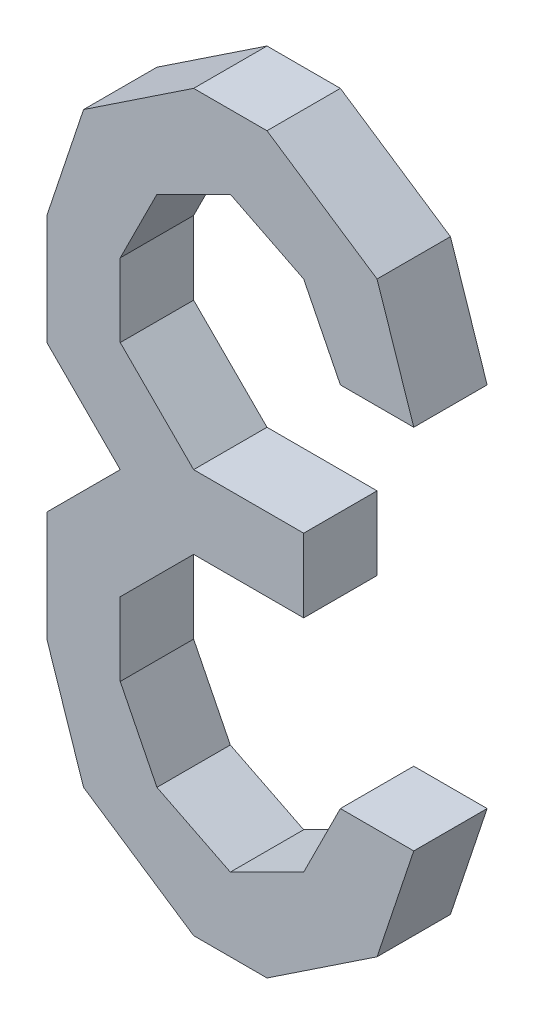
ISO-10303-21;
HEADER;
FILE_DESCRIPTION(('STEP AP214'),'2;1');
FILE_NAME('part.step','',(''),(''),'','','');
FILE_SCHEMA(('AUTOMOTIVE_DESIGN { 1 0 10303 214 1 1 1 1 }'));
ENDSEC;
DATA;
#1=APPLICATION_CONTEXT('core data for automotive mechanical design processes');
#2=APPLICATION_PROTOCOL_DEFINITION('international standard','automotive_design',2000,#1);
#3=PRODUCT_CONTEXT('',#1,'mechanical');
#4=PRODUCT('Part','Part','',(#3));
#5=PRODUCT_RELATED_PRODUCT_CATEGORY('part','',(#4));
#6=PRODUCT_DEFINITION_FORMATION('','',#4);
#7=PRODUCT_DEFINITION_CONTEXT('part definition',#1,'design');
#8=PRODUCT_DEFINITION('design','',#6,#7);
#9=PRODUCT_DEFINITION_SHAPE('','',#8);
#10=(LENGTH_UNIT() NAMED_UNIT(*) SI_UNIT(.MILLI.,.METRE.));
#11=(NAMED_UNIT(*) PLANE_ANGLE_UNIT() SI_UNIT($,.RADIAN.));
#12=(NAMED_UNIT(*) SI_UNIT($,.STERADIAN.) SOLID_ANGLE_UNIT());
#13=UNCERTAINTY_MEASURE_WITH_UNIT(LENGTH_MEASURE(1.E-05),#10,'distance_accuracy_value','');
#14=(GEOMETRIC_REPRESENTATION_CONTEXT(3) GLOBAL_UNCERTAINTY_ASSIGNED_CONTEXT((#13)) GLOBAL_UNIT_ASSIGNED_CONTEXT((#10,
#11,#12)) REPRESENTATION_CONTEXT('',''));
#15=CARTESIAN_POINT('',(0.,0.,0.));
#16=DIRECTION('',(0.,0.,1.));
#17=DIRECTION('',(1.,0.,0.));
#18=AXIS2_PLACEMENT_3D('',#15,#16,#17);
#19=CARTESIAN_POINT('',(0.0635,-0.0635,0.));
#20=DIRECTION('',(0.,0.,1.));
#21=DIRECTION('',(1.,0.,0.));
#22=AXIS2_PLACEMENT_3D('',#19,#20,#21);
#23=PLANE('',#22);
#24=DIRECTION('',(0.832050294337997,0.554700196224998,0.));
#25=VECTOR('',#24,1.);
#26=CARTESIAN_POINT('',(0.0508,-0.1016,0.));
#27=LINE('',#26,#25);
#28=CARTESIAN_POINT('',(0.0126999999999982,-0.126999999999997,0.));
#29=VERTEX_POINT('',#28);
#30=CARTESIAN_POINT('',(0.050799999999997,-0.101599999999999,0.));
#31=VERTEX_POINT('',#30);
#32=EDGE_CURVE('E376',#29,#31,#27,.T.);
#33=ORIENTED_EDGE('',*,*,#32,.F.);
#34=DIRECTION('',(1.,0.,0.));
#35=VECTOR('',#34,1.);
#36=CARTESIAN_POINT('',(0.0127,-0.127,0.));
#37=LINE('',#36,#35);
#38=CARTESIAN_POINT('',(-0.0127,-0.127,0.));
#39=VERTEX_POINT('',#38);
#40=EDGE_CURVE('E371',#39,#29,#37,.T.);
#41=ORIENTED_EDGE('',*,*,#40,.F.);
#42=DIRECTION('',(0.832050294337997,-0.554700196224998,0.));
#43=VECTOR('',#42,1.);
#44=CARTESIAN_POINT('',(-0.0127,-0.127,0.));
#45=LINE('',#44,#43);
#46=CARTESIAN_POINT('',(-0.0508000000000018,-0.101600000000003,0.));
#47=VERTEX_POINT('',#46);
#48=EDGE_CURVE('E366',#47,#39,#45,.T.);
#49=ORIENTED_EDGE('',*,*,#48,.F.);
#50=DIRECTION('',(0.316227766017138,-0.948683298050414,0.));
#51=VECTOR('',#50,1.);
#52=CARTESIAN_POINT('',(-0.0508,-0.1016,0.));
#53=LINE('',#52,#51);
#54=CARTESIAN_POINT('',(-0.063500000000003,-0.063500000000001,0.));
#55=VERTEX_POINT('',#54);
#56=EDGE_CURVE('E361',#55,#47,#53,.T.);
#57=ORIENTED_EDGE('',*,*,#56,.F.);
#58=DIRECTION('',(0.,1.,0.));
#59=VECTOR('',#58,1.);
#60=CARTESIAN_POINT('',(-0.0635,-0.0635,0.));
#61=LINE('',#60,#59);
#62=CARTESIAN_POINT('',(-0.0635,-0.02540000000002,0.));
#63=VERTEX_POINT('',#62);
#64=EDGE_CURVE('E356',#63,#55,#61,.F.);
#65=ORIENTED_EDGE('',*,*,#64,.F.);
#66=DIRECTION('',(-0.707106781186048,-0.707106781187048,0.));
#67=VECTOR('',#66,1.);
#68=CARTESIAN_POINT('',(-0.0635,-0.02540000000002,0.));
#69=LINE('',#68,#67);
#70=CARTESIAN_POINT('',(-0.038100000000002,0.,0.));
#71=VERTEX_POINT('',#70);
#72=EDGE_CURVE('E351',#71,#63,#69,.T.);
#73=ORIENTED_EDGE('',*,*,#72,.F.);
#74=DIRECTION('',(0.707106781187048,-0.707106781186048,0.));
#75=VECTOR('',#74,1.);
#76=CARTESIAN_POINT('',(-0.0381,0.,0.));
#77=LINE('',#76,#75);
#78=CARTESIAN_POINT('',(-0.0635000000000032,0.0253999999999868,0.));
#79=VERTEX_POINT('',#78);
#80=EDGE_CURVE('E346',#79,#71,#77,.T.);
#81=ORIENTED_EDGE('',*,*,#80,.F.);
#82=DIRECTION('',(0.,1.,0.));
#83=VECTOR('',#82,1.);
#84=CARTESIAN_POINT('',(-0.0635,0.02539999999999,0.));
#85=LINE('',#84,#83);
#86=CARTESIAN_POINT('',(-0.0635,0.06349999999998,0.));
#87=VERTEX_POINT('',#86);
#88=EDGE_CURVE('E341',#87,#79,#85,.F.);
#89=ORIENTED_EDGE('',*,*,#88,.F.);
#90=DIRECTION('',(-0.316227766017138,-0.948683298050414,0.));
#91=VECTOR('',#90,1.);
#92=CARTESIAN_POINT('',(-0.0635,0.06349999999998,0.));
#93=LINE('',#92,#91);
#94=CARTESIAN_POINT('',(-0.0507999999999955,0.101599999999998,0.));
#95=VERTEX_POINT('',#94);
#96=EDGE_CURVE('E336',#95,#87,#93,.T.);
#97=ORIENTED_EDGE('',*,*,#96,.F.);
#98=DIRECTION('',(-0.832050294337997,-0.554700196224998,0.));
#99=VECTOR('',#98,1.);
#100=CARTESIAN_POINT('',(-0.0508,0.1016,0.));
#101=LINE('',#100,#99);
#102=CARTESIAN_POINT('',(-0.0126999999999982,0.126999999999997,0.));
#103=VERTEX_POINT('',#102);
#104=EDGE_CURVE('E331',#103,#95,#101,.T.);
#105=ORIENTED_EDGE('',*,*,#104,.F.);
#106=DIRECTION('',(1.,0.,0.));
#107=VECTOR('',#106,1.);
#108=CARTESIAN_POINT('',(-0.0127,0.127,0.));
#109=LINE('',#108,#107);
#110=CARTESIAN_POINT('',(0.0127,0.127,0.));
#111=VERTEX_POINT('',#110);
#112=EDGE_CURVE('E326',#111,#103,#109,.F.);
#113=ORIENTED_EDGE('',*,*,#112,.F.);
#114=DIRECTION('',(-0.832050294337997,0.554700196224998,0.));
#115=VECTOR('',#114,1.);
#116=CARTESIAN_POINT('',(0.0127,0.127,0.));
#117=LINE('',#116,#115);
#118=CARTESIAN_POINT('',(0.0508000000000018,0.101600000000003,0.));
#119=VERTEX_POINT('',#118);
#120=EDGE_CURVE('E321',#119,#111,#117,.T.);
#121=ORIENTED_EDGE('',*,*,#120,.F.);
#122=DIRECTION('',(-0.316227766017138,0.948683298050414,0.));
#123=VECTOR('',#122,1.);
#124=CARTESIAN_POINT('',(0.0508,0.1016,0.));
#125=LINE('',#124,#123);
#126=CARTESIAN_POINT('',(0.0635000000000045,0.0634999999999815,0.));
#127=VERTEX_POINT('',#126);
#128=EDGE_CURVE('E316',#127,#119,#125,.T.);
#129=ORIENTED_EDGE('',*,*,#128,.F.);
#130=DIRECTION('',(1.,0.,0.));
#131=VECTOR('',#130,1.);
#132=CARTESIAN_POINT('',(0.0635,0.06349999999998,0.));
#133=LINE('',#132,#131);
#134=CARTESIAN_POINT('',(0.0381,0.06349999999998,0.));
#135=VERTEX_POINT('',#134);
#136=EDGE_CURVE('E311',#135,#127,#133,.T.);
#137=ORIENTED_EDGE('',*,*,#136,.F.);
#138=DIRECTION('',(0.447213595499958,-0.894427190999916,0.));
#139=VECTOR('',#138,1.);
#140=CARTESIAN_POINT('',(0.0381,0.06349999999998,0.));
#141=LINE('',#140,#139);
#142=CARTESIAN_POINT('',(0.025399999999998,0.088899999999999,0.));
#143=VERTEX_POINT('',#142);
#144=EDGE_CURVE('E306',#143,#135,#141,.T.);
#145=ORIENTED_EDGE('',*,*,#144,.F.);
#146=DIRECTION('',(0.894427190999916,-0.447213595499958,0.));
#147=VECTOR('',#146,1.);
#148=CARTESIAN_POINT('',(0.0254,0.0889,0.));
#149=LINE('',#148,#147);
#150=CARTESIAN_POINT('',(0.,0.1016,0.));
#151=VERTEX_POINT('',#150);
#152=EDGE_CURVE('E301',#151,#143,#149,.T.);
#153=ORIENTED_EDGE('',*,*,#152,.F.);
#154=DIRECTION('',(0.894427190999916,0.447213595499958,0.));
#155=VECTOR('',#154,1.);
#156=CARTESIAN_POINT('',(0.,0.1016,0.));
#157=LINE('',#156,#155);
#158=CARTESIAN_POINT('',(-0.0254,0.0889,0.));
#159=VERTEX_POINT('',#158);
#160=EDGE_CURVE('E296',#159,#151,#157,.T.);
#161=ORIENTED_EDGE('',*,*,#160,.F.);
#162=DIRECTION('',(0.447213595499958,0.894427190999916,0.));
#163=VECTOR('',#162,1.);
#164=CARTESIAN_POINT('',(-0.0254,0.0889,0.));
#165=LINE('',#164,#163);
#166=CARTESIAN_POINT('',(-0.038100000000002,0.0634999999999811,0.));
#167=VERTEX_POINT('',#166);
#168=EDGE_CURVE('E291',#167,#159,#165,.T.);
#169=ORIENTED_EDGE('',*,*,#168,.F.);
#170=DIRECTION('',(0.,1.,0.));
#171=VECTOR('',#170,1.);
#172=CARTESIAN_POINT('',(-0.0381,0.06349999999998,0.));
#173=LINE('',#172,#171);
#174=CARTESIAN_POINT('',(-0.0381,0.03809999999999,0.));
#175=VERTEX_POINT('',#174);
#176=EDGE_CURVE('E286',#175,#167,#173,.T.);
#177=ORIENTED_EDGE('',*,*,#176,.F.);
#178=DIRECTION('',(-0.707106781187048,0.707106781186048,0.));
#179=VECTOR('',#178,1.);
#180=CARTESIAN_POINT('',(-0.0381,0.03809999999999,0.));
#181=LINE('',#180,#179);
#182=CARTESIAN_POINT('',(-0.0126999999999968,0.0127000000000032,0.));
#183=VERTEX_POINT('',#182);
#184=EDGE_CURVE('E281',#183,#175,#181,.T.);
#185=ORIENTED_EDGE('',*,*,#184,.F.);
#186=DIRECTION('',(1.,0.,0.));
#187=VECTOR('',#186,1.);
#188=CARTESIAN_POINT('',(-0.0127,0.0127,0.));
#189=LINE('',#188,#187);
#190=CARTESIAN_POINT('',(0.0254,0.0127,0.));
#191=VERTEX_POINT('',#190);
#192=EDGE_CURVE('E276',#191,#183,#189,.F.);
#193=ORIENTED_EDGE('',*,*,#192,.F.);
#194=DIRECTION('',(0.,1.,0.));
#195=VECTOR('',#194,1.);
#196=CARTESIAN_POINT('',(0.0254,0.0127,0.));
#197=LINE('',#196,#195);
#198=CARTESIAN_POINT('',(0.0254,-0.01270000000002,0.));
#199=VERTEX_POINT('',#198);
#200=EDGE_CURVE('E271',#199,#191,#197,.T.);
#201=ORIENTED_EDGE('',*,*,#200,.F.);
#202=DIRECTION('',(1.,0.,0.));
#203=VECTOR('',#202,1.);
#204=CARTESIAN_POINT('',(0.0254,-0.01270000000002,0.));
#205=LINE('',#204,#203);
#206=CARTESIAN_POINT('',(-0.0127,-0.01270000000002,0.));
#207=VERTEX_POINT('',#206);
#208=EDGE_CURVE('E266',#207,#199,#205,.T.);
#209=ORIENTED_EDGE('',*,*,#208,.F.);
#210=DIRECTION('',(0.707106781187048,0.707106781186048,0.));
#211=VECTOR('',#210,1.);
#212=CARTESIAN_POINT('',(-0.0127,-0.01270000000002,0.));
#213=LINE('',#212,#211);
#214=CARTESIAN_POINT('',(-0.0381000000000032,-0.0381000000000068,0.));
#215=VERTEX_POINT('',#214);
#216=EDGE_CURVE('E261',#215,#207,#213,.T.);
#217=ORIENTED_EDGE('',*,*,#216,.F.);
#218=DIRECTION('',(0.,1.,0.));
#219=VECTOR('',#218,1.);
#220=CARTESIAN_POINT('',(-0.0381,-0.03810000000001,0.));
#221=LINE('',#220,#219);
#222=CARTESIAN_POINT('',(-0.0381,-0.0635,0.));
#223=VERTEX_POINT('',#222);
#224=EDGE_CURVE('E256',#223,#215,#221,.T.);
#225=ORIENTED_EDGE('',*,*,#224,.F.);
#226=DIRECTION('',(-0.447213595499958,0.894427190999916,0.));
#227=VECTOR('',#226,1.);
#228=CARTESIAN_POINT('',(-0.0381,-0.0635,0.));
#229=LINE('',#228,#227);
#230=CARTESIAN_POINT('',(-0.025399999999998,-0.088900000000019,0.));
#231=VERTEX_POINT('',#230);
#232=EDGE_CURVE('E251',#231,#223,#229,.T.);
#233=ORIENTED_EDGE('',*,*,#232,.F.);
#234=DIRECTION('',(-0.894427190999916,0.447213595499958,0.));
#235=VECTOR('',#234,1.);
#236=CARTESIAN_POINT('',(-0.0254,-0.08890000000002,0.));
#237=LINE('',#236,#235);
#238=CARTESIAN_POINT('',(0.,-0.101600000000004,0.));
#239=VERTEX_POINT('',#238);
#240=EDGE_CURVE('E246',#239,#231,#237,.T.);
#241=ORIENTED_EDGE('',*,*,#240,.F.);
#242=DIRECTION('',(-0.894427190999916,-0.447213595499958,0.));
#243=VECTOR('',#242,1.);
#244=CARTESIAN_POINT('',(0.,-0.1016,0.));
#245=LINE('',#244,#243);
#246=CARTESIAN_POINT('',(0.025399999999998,-0.088900000000016,0.));
#247=VERTEX_POINT('',#246);
#248=EDGE_CURVE('E232',#247,#239,#245,.T.);
#249=ORIENTED_EDGE('',*,*,#248,.F.);
#250=DIRECTION('',(-0.447213595499958,-0.894427190999916,0.));
#251=VECTOR('',#250,1.);
#252=CARTESIAN_POINT('',(0.0254,-0.08890000000002,0.));
#253=LINE('',#252,#251);
#254=CARTESIAN_POINT('',(0.038100000000002,-0.063500000000001,0.));
#255=VERTEX_POINT('',#254);
#256=EDGE_CURVE('E217',#255,#247,#253,.T.);
#257=ORIENTED_EDGE('',*,*,#256,.F.);
#258=DIRECTION('',(1.,0.,0.));
#259=VECTOR('',#258,1.);
#260=CARTESIAN_POINT('',(0.0381,-0.0635,0.));
#261=LINE('',#260,#259);
#262=CARTESIAN_POINT('',(0.0635,-0.0635,0.));
#263=VERTEX_POINT('',#262);
#264=EDGE_CURVE('E20',#263,#255,#261,.F.);
#265=ORIENTED_EDGE('',*,*,#264,.F.);
#266=DIRECTION('',(0.316227766017138,0.948683298050414,0.));
#267=VECTOR('',#266,1.);
#268=CARTESIAN_POINT('',(0.0635,-0.0635,0.));
#269=LINE('',#268,#267);
#270=EDGE_CURVE('E380',#31,#263,#269,.T.);
#271=ORIENTED_EDGE('',*,*,#270,.F.);
#272=EDGE_LOOP('',(#33,#41,#49,#57,#65,#73,#81,#89,#97,#105,#113,#121,#129,#137,#145,#153,#161,
#169,#177,#185,#193,#201,#209,#217,#225,#233,#241,#249,#257,#265,#271));
#273=FACE_BOUND('',#272,.T.);
#274=ADVANCED_FACE('F17',(#273),#23,.F.);
#275=CARTESIAN_POINT('',(0.0381,-0.0635,0.));
#276=DIRECTION('',(0.,1.,0.));
#277=DIRECTION('',(0.,0.,1.));
#278=AXIS2_PLACEMENT_3D('',#275,#276,#277);
#279=PLANE('',#278);
#280=DIRECTION('',(0.,0.,1.));
#281=VECTOR('',#280,1.);
#282=CARTESIAN_POINT('',(0.0635,-0.0635,0.));
#283=LINE('',#282,#281);
#284=CARTESIAN_POINT('',(0.0635,-0.0635,0.0254));
#285=VERTEX_POINT('',#284);
#286=EDGE_CURVE('E226',#263,#285,#283,.T.);
#287=ORIENTED_EDGE('',*,*,#286,.F.);
#288=ORIENTED_EDGE('',*,*,#264,.T.);
#289=DIRECTION('',(0.,0.,1.));
#290=VECTOR('',#289,1.);
#291=CARTESIAN_POINT('',(0.038100000000008,-0.063500000000004,0.));
#292=LINE('',#291,#290);
#293=CARTESIAN_POINT('',(0.038100000000002,-0.063500000000001,0.0254));
#294=VERTEX_POINT('',#293);
#295=EDGE_CURVE('E223',#294,#255,#292,.F.);
#296=ORIENTED_EDGE('',*,*,#295,.F.);
#297=DIRECTION('',(1.,0.,0.));
#298=VECTOR('',#297,1.);
#299=CARTESIAN_POINT('',(0.0635,-0.0635,0.0254));
#300=LINE('',#299,#298);
#301=EDGE_CURVE('E382',#285,#294,#300,.F.);
#302=ORIENTED_EDGE('',*,*,#301,.F.);
#303=EDGE_LOOP('',(#287,#288,#296,#302));
#304=FACE_BOUND('',#303,.T.);
#305=ADVANCED_FACE('F222',(#304),#279,.T.);
#306=CARTESIAN_POINT('',(0.0254,-0.08890000000002,0.));
#307=DIRECTION('',(-0.894427190999916,0.447213595499958,0.));
#308=DIRECTION('',(-0.447213595499958,-0.894427190999916,0.));
#309=AXIS2_PLACEMENT_3D('',#306,#307,#308);
#310=PLANE('',#309);
#311=ORIENTED_EDGE('',*,*,#295,.T.);
#312=ORIENTED_EDGE('',*,*,#256,.T.);
#313=DIRECTION('',(0.,0.,1.));
#314=VECTOR('',#313,1.);
#315=CARTESIAN_POINT('',(0.025399999999992,-0.088900000000004,0.));
#316=LINE('',#315,#314);
#317=CARTESIAN_POINT('',(0.025399999999998,-0.088900000000016,0.0254));
#318=VERTEX_POINT('',#317);
#319=EDGE_CURVE('E234',#318,#247,#316,.F.);
#320=ORIENTED_EDGE('',*,*,#319,.F.);
#321=DIRECTION('',(-0.447213595499676,-0.894427191000057,0.));
#322=VECTOR('',#321,1.);
#323=CARTESIAN_POINT('',(0.0381,-0.0635,0.0254));
#324=LINE('',#323,#322);
#325=EDGE_CURVE('E238',#294,#318,#324,.T.);
#326=ORIENTED_EDGE('',*,*,#325,.F.);
#327=EDGE_LOOP('',(#311,#312,#320,#326));
#328=FACE_BOUND('',#327,.T.);
#329=ADVANCED_FACE('F236',(#328),#310,.T.);
#330=CARTESIAN_POINT('',(0.,-0.1016,0.));
#331=DIRECTION('',(-0.447213595499958,0.894427190999916,0.));
#332=DIRECTION('',(-0.894427190999916,-0.447213595499958,0.));
#333=AXIS2_PLACEMENT_3D('',#330,#331,#332);
#334=PLANE('',#333);
#335=ORIENTED_EDGE('',*,*,#319,.T.);
#336=ORIENTED_EDGE('',*,*,#248,.T.);
#337=DIRECTION('',(0.,0.,1.));
#338=VECTOR('',#337,1.);
#339=CARTESIAN_POINT('',(0.,-0.101600000000016,0.));
#340=LINE('',#339,#338);
#341=CARTESIAN_POINT('',(0.,-0.101600000000004,0.0254));
#342=VERTEX_POINT('',#341);
#343=EDGE_CURVE('E243',#342,#239,#340,.F.);
#344=ORIENTED_EDGE('',*,*,#343,.F.);
#345=DIRECTION('',(-0.894427191000198,-0.447213595499394,0.));
#346=VECTOR('',#345,1.);
#347=CARTESIAN_POINT('',(0.0254,-0.08890000000002,0.0254));
#348=LINE('',#347,#346);
#349=EDGE_CURVE('E385',#318,#342,#348,.T.);
#350=ORIENTED_EDGE('',*,*,#349,.F.);
#351=EDGE_LOOP('',(#335,#336,#344,#350));
#352=FACE_BOUND('',#351,.T.);
#353=ADVANCED_FACE('F588',(#352),#334,.T.);
#354=CARTESIAN_POINT('',(-0.0254,-0.08890000000002,0.));
#355=DIRECTION('',(0.447213595499958,0.894427190999916,0.));
#356=DIRECTION('',(-0.894427190999916,0.447213595499958,0.));
#357=AXIS2_PLACEMENT_3D('',#354,#355,#356);
#358=PLANE('',#357);
#359=ORIENTED_EDGE('',*,*,#343,.T.);
#360=ORIENTED_EDGE('',*,*,#240,.T.);
#361=DIRECTION('',(0.,0.,1.));
#362=VECTOR('',#361,1.);
#363=CARTESIAN_POINT('',(-0.025399999999992,-0.088900000000016,0.));
#364=LINE('',#363,#362);
#365=CARTESIAN_POINT('',(-0.025399999999998,-0.088900000000019,0.0254));
#366=VERTEX_POINT('',#365);
#367=EDGE_CURVE('E248',#366,#231,#364,.F.);
#368=ORIENTED_EDGE('',*,*,#367,.F.);
#369=DIRECTION('',(-0.894427191000198,0.447213595499394,0.));
#370=VECTOR('',#369,1.);
#371=CARTESIAN_POINT('',(0.,-0.1016,0.0254));
#372=LINE('',#371,#370);
#373=EDGE_CURVE('E388',#342,#366,#372,.T.);
#374=ORIENTED_EDGE('',*,*,#373,.F.);
#375=EDGE_LOOP('',(#359,#360,#368,#374));
#376=FACE_BOUND('',#375,.T.);
#377=ADVANCED_FACE('F584',(#376),#358,.T.);
#378=CARTESIAN_POINT('',(-0.0381,-0.0635,0.));
#379=DIRECTION('',(0.894427190999916,0.447213595499958,0.));
#380=DIRECTION('',(-0.447213595499958,0.894427190999916,0.));
#381=AXIS2_PLACEMENT_3D('',#378,#379,#380);
#382=PLANE('',#381);
#383=ORIENTED_EDGE('',*,*,#367,.T.);
#384=ORIENTED_EDGE('',*,*,#232,.T.);
#385=DIRECTION('',(0.,0.,-1.));
#386=VECTOR('',#385,1.);
#387=CARTESIAN_POINT('',(-0.0381,-0.0635,0.));
#388=LINE('',#387,#386);
#389=CARTESIAN_POINT('',(-0.0381,-0.0635,0.0254));
#390=VERTEX_POINT('',#389);
#391=EDGE_CURVE('E253',#390,#223,#388,.T.);
#392=ORIENTED_EDGE('',*,*,#391,.F.);
#393=DIRECTION('',(-0.447213595499676,0.894427191000057,0.));
#394=VECTOR('',#393,1.);
#395=CARTESIAN_POINT('',(-0.0254,-0.08890000000002,0.0254));
#396=LINE('',#395,#394);
#397=EDGE_CURVE('E391',#366,#390,#396,.T.);
#398=ORIENTED_EDGE('',*,*,#397,.F.);
#399=EDGE_LOOP('',(#383,#384,#392,#398));
#400=FACE_BOUND('',#399,.T.);
#401=ADVANCED_FACE('F580',(#400),#382,.T.);
#402=CARTESIAN_POINT('',(-0.0381,-0.03810000000001,0.));
#403=DIRECTION('',(1.,0.,0.));
#404=DIRECTION('',(0.,0.,-1.));
#405=AXIS2_PLACEMENT_3D('',#402,#403,#404);
#406=PLANE('',#405);
#407=ORIENTED_EDGE('',*,*,#391,.T.);
#408=ORIENTED_EDGE('',*,*,#224,.T.);
#409=DIRECTION('',(0.,0.,1.));
#410=VECTOR('',#409,1.);
#411=CARTESIAN_POINT('',(-0.038100000000013,-0.038099999999997,0.));
#412=LINE('',#411,#410);
#413=CARTESIAN_POINT('',(-0.0381000000000032,-0.0381000000000068,0.0254));
#414=VERTEX_POINT('',#413);
#415=EDGE_CURVE('E258',#414,#215,#412,.F.);
#416=ORIENTED_EDGE('',*,*,#415,.F.);
#417=DIRECTION('',(0.,1.,0.));
#418=VECTOR('',#417,1.);
#419=CARTESIAN_POINT('',(-0.0381,-0.0635,0.0254));
#420=LINE('',#419,#418);
#421=EDGE_CURVE('E394',#390,#414,#420,.T.);
#422=ORIENTED_EDGE('',*,*,#421,.F.);
#423=EDGE_LOOP('',(#407,#408,#416,#422));
#424=FACE_BOUND('',#423,.T.);
#425=ADVANCED_FACE('F576',(#424),#406,.T.);
#426=CARTESIAN_POINT('',(-0.0127,-0.01270000000002,0.));
#427=DIRECTION('',(0.707106781186048,-0.707106781187048,0.));
#428=DIRECTION('',(0.707106781187048,0.707106781186048,0.));
#429=AXIS2_PLACEMENT_3D('',#426,#427,#428);
#430=PLANE('',#429);
#431=ORIENTED_EDGE('',*,*,#415,.T.);
#432=ORIENTED_EDGE('',*,*,#216,.T.);
#433=DIRECTION('',(0.,0.,-1.));
#434=VECTOR('',#433,1.);
#435=CARTESIAN_POINT('',(-0.0127,-0.01270000000002,0.));
#436=LINE('',#435,#434);
#437=CARTESIAN_POINT('',(-0.0127,-0.01270000000002,0.0254));
#438=VERTEX_POINT('',#437);
#439=EDGE_CURVE('E263',#438,#207,#436,.T.);
#440=ORIENTED_EDGE('',*,*,#439,.F.);
#441=DIRECTION('',(0.707106781186687,0.707106781186408,0.));
#442=VECTOR('',#441,1.);
#443=CARTESIAN_POINT('',(-0.0381,-0.03810000000001,0.0254));
#444=LINE('',#443,#442);
#445=EDGE_CURVE('E397',#414,#438,#444,.T.);
#446=ORIENTED_EDGE('',*,*,#445,.F.);
#447=EDGE_LOOP('',(#431,#432,#440,#446));
#448=FACE_BOUND('',#447,.T.);
#449=ADVANCED_FACE('F572',(#448),#430,.T.);
#450=CARTESIAN_POINT('',(0.0254,-0.01270000000002,0.));
#451=DIRECTION('',(0.,-1.,0.));
#452=DIRECTION('',(0.,0.,-1.));
#453=AXIS2_PLACEMENT_3D('',#450,#451,#452);
#454=PLANE('',#453);
#455=ORIENTED_EDGE('',*,*,#439,.T.);
#456=ORIENTED_EDGE('',*,*,#208,.T.);
#457=DIRECTION('',(0.,0.,-1.));
#458=VECTOR('',#457,1.);
#459=CARTESIAN_POINT('',(0.0254,-0.01270000000002,0.));
#460=LINE('',#459,#458);
#461=CARTESIAN_POINT('',(0.0254,-0.01270000000002,0.0254));
#462=VERTEX_POINT('',#461);
#463=EDGE_CURVE('E268',#462,#199,#460,.T.);
#464=ORIENTED_EDGE('',*,*,#463,.F.);
#465=DIRECTION('',(1.,0.,0.));
#466=VECTOR('',#465,1.);
#467=CARTESIAN_POINT('',(0.0635,-0.01270000000002,0.0254));
#468=LINE('',#467,#466);
#469=EDGE_CURVE('E400',#438,#462,#468,.T.);
#470=ORIENTED_EDGE('',*,*,#469,.F.);
#471=EDGE_LOOP('',(#455,#456,#464,#470));
#472=FACE_BOUND('',#471,.T.);
#473=ADVANCED_FACE('F568',(#472),#454,.T.);
#474=CARTESIAN_POINT('',(0.0254,0.0127,0.));
#475=DIRECTION('',(1.,0.,0.));
#476=DIRECTION('',(0.,0.,-1.));
#477=AXIS2_PLACEMENT_3D('',#474,#475,#476);
#478=PLANE('',#477);
#479=ORIENTED_EDGE('',*,*,#463,.T.);
#480=ORIENTED_EDGE('',*,*,#200,.T.);
#481=DIRECTION('',(0.,0.,1.));
#482=VECTOR('',#481,1.);
#483=CARTESIAN_POINT('',(0.0254,0.0127,0.));
#484=LINE('',#483,#482);
#485=CARTESIAN_POINT('',(0.0254,0.0127,0.0254));
#486=VERTEX_POINT('',#485);
#487=EDGE_CURVE('E273',#486,#191,#484,.F.);
#488=ORIENTED_EDGE('',*,*,#487,.F.);
#489=DIRECTION('',(0.,1.,0.));
#490=VECTOR('',#489,1.);
#491=CARTESIAN_POINT('',(0.0254,-0.0635,0.0254));
#492=LINE('',#491,#490);
#493=EDGE_CURVE('E403',#462,#486,#492,.T.);
#494=ORIENTED_EDGE('',*,*,#493,.F.);
#495=EDGE_LOOP('',(#479,#480,#488,#494));
#496=FACE_BOUND('',#495,.T.);
#497=ADVANCED_FACE('F564',(#496),#478,.T.);
#498=CARTESIAN_POINT('',(-0.0127,0.0127,0.));
#499=DIRECTION('',(0.,1.,0.));
#500=DIRECTION('',(0.,0.,1.));
#501=AXIS2_PLACEMENT_3D('',#498,#499,#500);
#502=PLANE('',#501);
#503=ORIENTED_EDGE('',*,*,#487,.T.);
#504=ORIENTED_EDGE('',*,*,#192,.T.);
#505=DIRECTION('',(0.,0.,1.));
#506=VECTOR('',#505,1.);
#507=CARTESIAN_POINT('',(-0.012699999999987,0.012700000000013,0.));
#508=LINE('',#507,#506);
#509=CARTESIAN_POINT('',(-0.0126999999999968,0.0127000000000032,0.0254));
#510=VERTEX_POINT('',#509);
#511=EDGE_CURVE('E278',#510,#183,#508,.F.);
#512=ORIENTED_EDGE('',*,*,#511,.F.);
#513=DIRECTION('',(1.,0.,0.));
#514=VECTOR('',#513,1.);
#515=CARTESIAN_POINT('',(0.0635,0.0127,0.0254));
#516=LINE('',#515,#514);
#517=EDGE_CURVE('E406',#486,#510,#516,.F.);
#518=ORIENTED_EDGE('',*,*,#517,.F.);
#519=EDGE_LOOP('',(#503,#504,#512,#518));
#520=FACE_BOUND('',#519,.T.);
#521=ADVANCED_FACE('F560',(#520),#502,.T.);
#522=CARTESIAN_POINT('',(-0.0381,0.03809999999999,0.));
#523=DIRECTION('',(0.707106781186048,0.707106781187048,0.));
#524=DIRECTION('',(-0.707106781187048,0.707106781186048,0.));
#525=AXIS2_PLACEMENT_3D('',#522,#523,#524);
#526=PLANE('',#525);
#527=ORIENTED_EDGE('',*,*,#511,.T.);
#528=ORIENTED_EDGE('',*,*,#184,.T.);
#529=DIRECTION('',(0.,0.,-1.));
#530=VECTOR('',#529,1.);
#531=CARTESIAN_POINT('',(-0.0381,0.03809999999999,0.));
#532=LINE('',#531,#530);
#533=CARTESIAN_POINT('',(-0.0381,0.03809999999999,0.0254));
#534=VERTEX_POINT('',#533);
#535=EDGE_CURVE('E283',#534,#175,#532,.T.);
#536=ORIENTED_EDGE('',*,*,#535,.F.);
#537=DIRECTION('',(-0.707106781186687,0.707106781186408,0.));
#538=VECTOR('',#537,1.);
#539=CARTESIAN_POINT('',(-0.0127,0.0127,0.0254));
#540=LINE('',#539,#538);
#541=EDGE_CURVE('E409',#510,#534,#540,.T.);
#542=ORIENTED_EDGE('',*,*,#541,.F.);
#543=EDGE_LOOP('',(#527,#528,#536,#542));
#544=FACE_BOUND('',#543,.T.);
#545=ADVANCED_FACE('F556',(#544),#526,.T.);
#546=CARTESIAN_POINT('',(-0.0381,0.06349999999998,0.));
#547=DIRECTION('',(1.,0.,0.));
#548=DIRECTION('',(0.,0.,-1.));
#549=AXIS2_PLACEMENT_3D('',#546,#547,#548);
#550=PLANE('',#549);
#551=ORIENTED_EDGE('',*,*,#535,.T.);
#552=ORIENTED_EDGE('',*,*,#176,.T.);
#553=DIRECTION('',(0.,0.,1.));
#554=VECTOR('',#553,1.);
#555=CARTESIAN_POINT('',(-0.038100000000008,0.063499999999984,0.));
#556=LINE('',#555,#554);
#557=CARTESIAN_POINT('',(-0.038100000000002,0.0634999999999811,0.0254));
#558=VERTEX_POINT('',#557);
#559=EDGE_CURVE('E288',#558,#167,#556,.F.);
#560=ORIENTED_EDGE('',*,*,#559,.F.);
#561=DIRECTION('',(0.,1.,0.));
#562=VECTOR('',#561,1.);
#563=CARTESIAN_POINT('',(-0.0381,-0.0635,0.0254));
#564=LINE('',#563,#562);
#565=EDGE_CURVE('E412',#534,#558,#564,.T.);
#566=ORIENTED_EDGE('',*,*,#565,.F.);
#567=EDGE_LOOP('',(#551,#552,#560,#566));
#568=FACE_BOUND('',#567,.T.);
#569=ADVANCED_FACE('F552',(#568),#550,.T.);
#570=CARTESIAN_POINT('',(-0.0254,0.0889,0.));
#571=DIRECTION('',(0.894427190999916,-0.447213595499958,0.));
#572=DIRECTION('',(0.447213595499958,0.894427190999916,0.));
#573=AXIS2_PLACEMENT_3D('',#570,#571,#572);
#574=PLANE('',#573);
#575=ORIENTED_EDGE('',*,*,#559,.T.);
#576=ORIENTED_EDGE('',*,*,#168,.T.);
#577=DIRECTION('',(0.,0.,1.));
#578=VECTOR('',#577,1.);
#579=CARTESIAN_POINT('',(-0.0254,0.0889,0.));
#580=LINE('',#579,#578);
#581=CARTESIAN_POINT('',(-0.0254,0.0889,0.0254));
#582=VERTEX_POINT('',#581);
#583=EDGE_CURVE('E293',#582,#159,#580,.F.);
#584=ORIENTED_EDGE('',*,*,#583,.F.);
#585=DIRECTION('',(0.447213595499676,0.894427191000057,0.));
#586=VECTOR('',#585,1.);
#587=CARTESIAN_POINT('',(-0.0381,0.06349999999998,0.0254));
#588=LINE('',#587,#586);
#589=EDGE_CURVE('E415',#558,#582,#588,.T.);
#590=ORIENTED_EDGE('',*,*,#589,.F.);
#591=EDGE_LOOP('',(#575,#576,#584,#590));
#592=FACE_BOUND('',#591,.T.);
#593=ADVANCED_FACE('F548',(#592),#574,.T.);
#594=CARTESIAN_POINT('',(0.,0.1016,0.));
#595=DIRECTION('',(0.447213595499958,-0.894427190999916,0.));
#596=DIRECTION('',(0.894427190999916,0.447213595499958,0.));
#597=AXIS2_PLACEMENT_3D('',#594,#595,#596);
#598=PLANE('',#597);
#599=ORIENTED_EDGE('',*,*,#583,.T.);
#600=ORIENTED_EDGE('',*,*,#160,.T.);
#601=DIRECTION('',(0.,0.,1.));
#602=VECTOR('',#601,1.);
#603=CARTESIAN_POINT('',(0.,0.1016,0.));
#604=LINE('',#603,#602);
#605=CARTESIAN_POINT('',(0.,0.1016,0.0254));
#606=VERTEX_POINT('',#605);
#607=EDGE_CURVE('E298',#606,#151,#604,.F.);
#608=ORIENTED_EDGE('',*,*,#607,.F.);
#609=DIRECTION('',(0.894427190999916,0.447213595499958,0.));
#610=VECTOR('',#609,1.);
#611=CARTESIAN_POINT('',(-0.0254,0.0889,0.0254));
#612=LINE('',#611,#610);
#613=EDGE_CURVE('E418',#582,#606,#612,.T.);
#614=ORIENTED_EDGE('',*,*,#613,.F.);
#615=EDGE_LOOP('',(#599,#600,#608,#614));
#616=FACE_BOUND('',#615,.T.);
#617=ADVANCED_FACE('F544',(#616),#598,.T.);
#618=CARTESIAN_POINT('',(0.0254,0.0889,0.));
#619=DIRECTION('',(-0.447213595499958,-0.894427190999916,0.));
#620=DIRECTION('',(0.894427190999916,-0.447213595499958,0.));
#621=AXIS2_PLACEMENT_3D('',#618,#619,#620);
#622=PLANE('',#621);
#623=ORIENTED_EDGE('',*,*,#607,.T.);
#624=ORIENTED_EDGE('',*,*,#152,.T.);
#625=DIRECTION('',(0.,0.,1.));
#626=VECTOR('',#625,1.);
#627=CARTESIAN_POINT('',(0.025399999999992,0.088899999999996,0.));
#628=LINE('',#627,#626);
#629=CARTESIAN_POINT('',(0.025399999999998,0.088899999999999,0.0254));
#630=VERTEX_POINT('',#629);
#631=EDGE_CURVE('E303',#630,#143,#628,.F.);
#632=ORIENTED_EDGE('',*,*,#631,.F.);
#633=DIRECTION('',(0.894427190999916,-0.447213595499957,0.));
#634=VECTOR('',#633,1.);
#635=CARTESIAN_POINT('',(0.,0.1016,0.0254));
#636=LINE('',#635,#634);
#637=EDGE_CURVE('E421',#606,#630,#636,.T.);
#638=ORIENTED_EDGE('',*,*,#637,.F.);
#639=EDGE_LOOP('',(#623,#624,#632,#638));
#640=FACE_BOUND('',#639,.T.);
#641=ADVANCED_FACE('F540',(#640),#622,.T.);
#642=CARTESIAN_POINT('',(0.0381,0.06349999999998,0.));
#643=DIRECTION('',(-0.894427190999916,-0.447213595499958,0.));
#644=DIRECTION('',(0.447213595499958,-0.894427190999916,0.));
#645=AXIS2_PLACEMENT_3D('',#642,#643,#644);
#646=PLANE('',#645);
#647=ORIENTED_EDGE('',*,*,#631,.T.);
#648=ORIENTED_EDGE('',*,*,#144,.T.);
#649=DIRECTION('',(0.,0.,-1.));
#650=VECTOR('',#649,1.);
#651=CARTESIAN_POINT('',(0.0381,0.06349999999998,0.));
#652=LINE('',#651,#650);
#653=CARTESIAN_POINT('',(0.0381,0.06349999999998,0.0254));
#654=VERTEX_POINT('',#653);
#655=EDGE_CURVE('E308',#654,#135,#652,.T.);
#656=ORIENTED_EDGE('',*,*,#655,.F.);
#657=DIRECTION('',(0.447213595499676,-0.894427191000057,0.));
#658=VECTOR('',#657,1.);
#659=CARTESIAN_POINT('',(0.0254,0.0889,0.0254));
#660=LINE('',#659,#658);
#661=EDGE_CURVE('E424',#630,#654,#660,.T.);
#662=ORIENTED_EDGE('',*,*,#661,.F.);
#663=EDGE_LOOP('',(#647,#648,#656,#662));
#664=FACE_BOUND('',#663,.T.);
#665=ADVANCED_FACE('F536',(#664),#646,.T.);
#666=CARTESIAN_POINT('',(0.0635,0.06349999999998,0.));
#667=DIRECTION('',(0.,-1.,0.));
#668=DIRECTION('',(0.,0.,-1.));
#669=AXIS2_PLACEMENT_3D('',#666,#667,#668);
#670=PLANE('',#669);
#671=ORIENTED_EDGE('',*,*,#655,.T.);
#672=ORIENTED_EDGE('',*,*,#136,.T.);
#673=DIRECTION('',(0.,0.,1.));
#674=VECTOR('',#673,1.);
#675=CARTESIAN_POINT('',(0.0635000000000181,0.063499999999986,0.));
#676=LINE('',#675,#674);
#677=CARTESIAN_POINT('',(0.0635000000000045,0.0634999999999815,0.0254));
#678=VERTEX_POINT('',#677);
#679=EDGE_CURVE('E313',#678,#127,#676,.F.);
#680=ORIENTED_EDGE('',*,*,#679,.F.);
#681=DIRECTION('',(1.,0.,0.));
#682=VECTOR('',#681,1.);
#683=CARTESIAN_POINT('',(0.0635,0.06349999999998,0.0254));
#684=LINE('',#683,#682);
#685=EDGE_CURVE('E427',#654,#678,#684,.T.);
#686=ORIENTED_EDGE('',*,*,#685,.F.);
#687=EDGE_LOOP('',(#671,#672,#680,#686));
#688=FACE_BOUND('',#687,.T.);
#689=ADVANCED_FACE('F532',(#688),#670,.T.);
#690=CARTESIAN_POINT('',(0.0508,0.1016,0.));
#691=DIRECTION('',(0.948683298050414,0.316227766017138,0.));
#692=DIRECTION('',(-0.316227766017138,0.948683298050414,0.));
#693=AXIS2_PLACEMENT_3D('',#690,#691,#692);
#694=PLANE('',#693);
#695=ORIENTED_EDGE('',*,*,#679,.T.);
#696=ORIENTED_EDGE('',*,*,#128,.T.);
#697=DIRECTION('',(0.,0.,1.));
#698=VECTOR('',#697,1.);
#699=CARTESIAN_POINT('',(0.050800000000007,0.101600000000011,0.));
#700=LINE('',#699,#698);
#701=CARTESIAN_POINT('',(0.0508000000000018,0.101600000000003,0.0254));
#702=VERTEX_POINT('',#701);
#703=EDGE_CURVE('E318',#702,#119,#700,.F.);
#704=ORIENTED_EDGE('',*,*,#703,.F.);
#705=DIRECTION('',(-0.316227766016688,0.948683298050564,0.));
#706=VECTOR('',#705,1.);
#707=CARTESIAN_POINT('',(0.0635,0.06349999999998,0.0254));
#708=LINE('',#707,#706);
#709=EDGE_CURVE('E430',#678,#702,#708,.T.);
#710=ORIENTED_EDGE('',*,*,#709,.F.);
#711=EDGE_LOOP('',(#695,#696,#704,#710));
#712=FACE_BOUND('',#711,.T.);
#713=ADVANCED_FACE('F528',(#712),#694,.T.);
#714=CARTESIAN_POINT('',(0.0127,0.127,0.));
#715=DIRECTION('',(0.554700196224998,0.832050294337997,0.));
#716=DIRECTION('',(-0.832050294337997,0.554700196224998,0.));
#717=AXIS2_PLACEMENT_3D('',#714,#715,#716);
#718=PLANE('',#717);
#719=ORIENTED_EDGE('',*,*,#703,.T.);
#720=ORIENTED_EDGE('',*,*,#120,.T.);
#721=DIRECTION('',(0.,0.,1.));
#722=VECTOR('',#721,1.);
#723=CARTESIAN_POINT('',(0.0127,0.127,0.));
#724=LINE('',#723,#722);
#725=CARTESIAN_POINT('',(0.0127,0.127,0.0254));
#726=VERTEX_POINT('',#725);
#727=EDGE_CURVE('E323',#726,#111,#724,.F.);
#728=ORIENTED_EDGE('',*,*,#727,.F.);
#729=DIRECTION('',(-0.832050294337844,0.554700196225229,0.));
#730=VECTOR('',#729,1.);
#731=CARTESIAN_POINT('',(0.0508,0.1016,0.0254));
#732=LINE('',#731,#730);
#733=EDGE_CURVE('E433',#702,#726,#732,.T.);
#734=ORIENTED_EDGE('',*,*,#733,.F.);
#735=EDGE_LOOP('',(#719,#720,#728,#734));
#736=FACE_BOUND('',#735,.T.);
#737=ADVANCED_FACE('F524',(#736),#718,.T.);
#738=CARTESIAN_POINT('',(-0.0127,0.127,0.));
#739=DIRECTION('',(0.,1.,0.));
#740=DIRECTION('',(0.,0.,1.));
#741=AXIS2_PLACEMENT_3D('',#738,#739,#740);
#742=PLANE('',#741);
#743=ORIENTED_EDGE('',*,*,#727,.T.);
#744=ORIENTED_EDGE('',*,*,#112,.T.);
#745=DIRECTION('',(0.,0.,1.));
#746=VECTOR('',#745,1.);
#747=CARTESIAN_POINT('',(-0.012699999999993,0.126999999999989,0.));
#748=LINE('',#747,#746);
#749=CARTESIAN_POINT('',(-0.0126999999999982,0.126999999999997,0.0254));
#750=VERTEX_POINT('',#749);
#751=EDGE_CURVE('E328',#750,#103,#748,.F.);
#752=ORIENTED_EDGE('',*,*,#751,.F.);
#753=DIRECTION('',(1.,0.,0.));
#754=VECTOR('',#753,1.);
#755=CARTESIAN_POINT('',(0.0635,0.127,0.0254));
#756=LINE('',#755,#754);
#757=EDGE_CURVE('E436',#726,#750,#756,.F.);
#758=ORIENTED_EDGE('',*,*,#757,.F.);
#759=EDGE_LOOP('',(#743,#744,#752,#758));
#760=FACE_BOUND('',#759,.T.);
#761=ADVANCED_FACE('F520',(#760),#742,.T.);
#762=CARTESIAN_POINT('',(-0.0508,0.1016,0.));
#763=DIRECTION('',(-0.554700196224998,0.832050294337997,0.));
#764=DIRECTION('',(-0.832050294337997,-0.554700196224998,0.));
#765=AXIS2_PLACEMENT_3D('',#762,#763,#764);
#766=PLANE('',#765);
#767=ORIENTED_EDGE('',*,*,#751,.T.);
#768=ORIENTED_EDGE('',*,*,#104,.T.);
#769=DIRECTION('',(0.,0.,1.));
#770=VECTOR('',#769,1.);
#771=CARTESIAN_POINT('',(-0.0507999999999819,0.101599999999994,0.));
#772=LINE('',#771,#770);
#773=CARTESIAN_POINT('',(-0.0507999999999955,0.101599999999998,0.0254));
#774=VERTEX_POINT('',#773);
#775=EDGE_CURVE('E333',#774,#95,#772,.F.);
#776=ORIENTED_EDGE('',*,*,#775,.F.);
#777=DIRECTION('',(-0.832050294337844,-0.554700196225229,0.));
#778=VECTOR('',#777,1.);
#779=CARTESIAN_POINT('',(-0.0127,0.127,0.0254));
#780=LINE('',#779,#778);
#781=EDGE_CURVE('E439',#750,#774,#780,.T.);
#782=ORIENTED_EDGE('',*,*,#781,.F.);
#783=EDGE_LOOP('',(#767,#768,#776,#782));
#784=FACE_BOUND('',#783,.T.);
#785=ADVANCED_FACE('F516',(#784),#766,.T.);
#786=CARTESIAN_POINT('',(-0.0635,0.06349999999998,0.));
#787=DIRECTION('',(-0.948683298050414,0.316227766017138,0.));
#788=DIRECTION('',(-0.316227766017138,-0.948683298050414,0.));
#789=AXIS2_PLACEMENT_3D('',#786,#787,#788);
#790=PLANE('',#789);
#791=ORIENTED_EDGE('',*,*,#775,.T.);
#792=ORIENTED_EDGE('',*,*,#96,.T.);
#793=DIRECTION('',(0.,0.,1.));
#794=VECTOR('',#793,1.);
#795=CARTESIAN_POINT('',(-0.0635,0.06349999999998,0.));
#796=LINE('',#795,#794);
#797=CARTESIAN_POINT('',(-0.0635,0.06349999999998,0.0254));
#798=VERTEX_POINT('',#797);
#799=EDGE_CURVE('E338',#798,#87,#796,.F.);
#800=ORIENTED_EDGE('',*,*,#799,.F.);
#801=DIRECTION('',(-0.316227766016688,-0.948683298050564,0.));
#802=VECTOR('',#801,1.);
#803=CARTESIAN_POINT('',(-0.0508,0.1016,0.0254));
#804=LINE('',#803,#802);
#805=EDGE_CURVE('E442',#774,#798,#804,.T.);
#806=ORIENTED_EDGE('',*,*,#805,.F.);
#807=EDGE_LOOP('',(#791,#792,#800,#806));
#808=FACE_BOUND('',#807,.T.);
#809=ADVANCED_FACE('F512',(#808),#790,.T.);
#810=CARTESIAN_POINT('',(-0.0635,0.02539999999999,0.));
#811=DIRECTION('',(-1.,0.,0.));
#812=DIRECTION('',(0.,0.,1.));
#813=AXIS2_PLACEMENT_3D('',#810,#811,#812);
#814=PLANE('',#813);
#815=ORIENTED_EDGE('',*,*,#799,.T.);
#816=ORIENTED_EDGE('',*,*,#88,.T.);
#817=DIRECTION('',(0.,0.,1.));
#818=VECTOR('',#817,1.);
#819=CARTESIAN_POINT('',(-0.063500000000013,0.025399999999977,0.));
#820=LINE('',#819,#818);
#821=CARTESIAN_POINT('',(-0.0635000000000032,0.0253999999999868,0.0254));
#822=VERTEX_POINT('',#821);
#823=EDGE_CURVE('E343',#822,#79,#820,.F.);
#824=ORIENTED_EDGE('',*,*,#823,.F.);
#825=DIRECTION('',(0.,1.,0.));
#826=VECTOR('',#825,1.);
#827=CARTESIAN_POINT('',(-0.0635,-0.0635,0.0254));
#828=LINE('',#827,#826);
#829=EDGE_CURVE('E445',#798,#822,#828,.F.);
#830=ORIENTED_EDGE('',*,*,#829,.F.);
#831=EDGE_LOOP('',(#815,#816,#824,#830));
#832=FACE_BOUND('',#831,.T.);
#833=ADVANCED_FACE('F508',(#832),#814,.T.);
#834=CARTESIAN_POINT('',(-0.0381,0.,0.));
#835=DIRECTION('',(-0.707106781186048,-0.707106781187048,0.));
#836=DIRECTION('',(0.707106781187048,-0.707106781186048,0.));
#837=AXIS2_PLACEMENT_3D('',#834,#835,#836);
#838=PLANE('',#837);
#839=ORIENTED_EDGE('',*,*,#823,.T.);
#840=ORIENTED_EDGE('',*,*,#80,.T.);
#841=DIRECTION('',(0.,0.,1.));
#842=VECTOR('',#841,1.);
#843=CARTESIAN_POINT('',(-0.038100000000008,0.,0.));
#844=LINE('',#843,#842);
#845=CARTESIAN_POINT('',(-0.038100000000002,0.,0.0254));
#846=VERTEX_POINT('',#845);
#847=EDGE_CURVE('E348',#846,#71,#844,.F.);
#848=ORIENTED_EDGE('',*,*,#847,.F.);
#849=DIRECTION('',(0.707106781186687,-0.707106781186408,0.));
#850=VECTOR('',#849,1.);
#851=CARTESIAN_POINT('',(-0.0635,0.02539999999999,0.0254));
#852=LINE('',#851,#850);
#853=EDGE_CURVE('E448',#822,#846,#852,.T.);
#854=ORIENTED_EDGE('',*,*,#853,.F.);
#855=EDGE_LOOP('',(#839,#840,#848,#854));
#856=FACE_BOUND('',#855,.T.);
#857=ADVANCED_FACE('F504',(#856),#838,.T.);
#858=CARTESIAN_POINT('',(-0.0635,-0.02540000000002,0.));
#859=DIRECTION('',(-0.707106781187048,0.707106781186048,0.));
#860=DIRECTION('',(-0.707106781186048,-0.707106781187048,0.));
#861=AXIS2_PLACEMENT_3D('',#858,#859,#860);
#862=PLANE('',#861);
#863=ORIENTED_EDGE('',*,*,#847,.T.);
#864=ORIENTED_EDGE('',*,*,#72,.T.);
#865=DIRECTION('',(0.,0.,1.));
#866=VECTOR('',#865,1.);
#867=CARTESIAN_POINT('',(-0.0635,-0.02540000000002,0.));
#868=LINE('',#867,#866);
#869=CARTESIAN_POINT('',(-0.0635,-0.02540000000002,0.0254));
#870=VERTEX_POINT('',#869);
#871=EDGE_CURVE('E353',#870,#63,#868,.F.);
#872=ORIENTED_EDGE('',*,*,#871,.F.);
#873=DIRECTION('',(-0.707106781186269,-0.707106781186826,0.));
#874=VECTOR('',#873,1.);
#875=CARTESIAN_POINT('',(-0.0381,0.,0.0254));
#876=LINE('',#875,#874);
#877=EDGE_CURVE('E451',#846,#870,#876,.T.);
#878=ORIENTED_EDGE('',*,*,#877,.F.);
#879=EDGE_LOOP('',(#863,#864,#872,#878));
#880=FACE_BOUND('',#879,.T.);
#881=ADVANCED_FACE('F500',(#880),#862,.T.);
#882=CARTESIAN_POINT('',(-0.0635,-0.0635,0.));
#883=DIRECTION('',(-1.,0.,0.));
#884=DIRECTION('',(0.,0.,1.));
#885=AXIS2_PLACEMENT_3D('',#882,#883,#884);
#886=PLANE('',#885);
#887=ORIENTED_EDGE('',*,*,#871,.T.);
#888=ORIENTED_EDGE('',*,*,#64,.T.);
#889=DIRECTION('',(0.,0.,1.));
#890=VECTOR('',#889,1.);
#891=CARTESIAN_POINT('',(-0.0635000000000121,-0.063500000000004,0.));
#892=LINE('',#891,#890);
#893=CARTESIAN_POINT('',(-0.063500000000003,-0.063500000000001,0.0254));
#894=VERTEX_POINT('',#893);
#895=EDGE_CURVE('E358',#894,#55,#892,.F.);
#896=ORIENTED_EDGE('',*,*,#895,.F.);
#897=DIRECTION('',(0.,1.,0.));
#898=VECTOR('',#897,1.);
#899=CARTESIAN_POINT('',(-0.0635,-0.0635,0.0254));
#900=LINE('',#899,#898);
#901=EDGE_CURVE('E454',#870,#894,#900,.F.);
#902=ORIENTED_EDGE('',*,*,#901,.F.);
#903=EDGE_LOOP('',(#887,#888,#896,#902));
#904=FACE_BOUND('',#903,.T.);
#905=ADVANCED_FACE('F496',(#904),#886,.T.);
#906=CARTESIAN_POINT('',(-0.0508,-0.1016,0.));
#907=DIRECTION('',(-0.948683298050414,-0.316227766017138,0.));
#908=DIRECTION('',(0.316227766017138,-0.948683298050414,0.));
#909=AXIS2_PLACEMENT_3D('',#906,#907,#908);
#910=PLANE('',#909);
#911=ORIENTED_EDGE('',*,*,#895,.T.);
#912=ORIENTED_EDGE('',*,*,#56,.T.);
#913=DIRECTION('',(0.,0.,1.));
#914=VECTOR('',#913,1.);
#915=CARTESIAN_POINT('',(-0.050800000000007,-0.101600000000011,0.));
#916=LINE('',#915,#914);
#917=CARTESIAN_POINT('',(-0.0508000000000018,-0.101600000000003,0.0254));
#918=VERTEX_POINT('',#917);
#919=EDGE_CURVE('E363',#918,#47,#916,.F.);
#920=ORIENTED_EDGE('',*,*,#919,.F.);
#921=DIRECTION('',(0.316227766016838,-0.948683298050514,0.));
#922=VECTOR('',#921,1.);
#923=CARTESIAN_POINT('',(-0.0635,-0.0635,0.0254));
#924=LINE('',#923,#922);
#925=EDGE_CURVE('E457',#894,#918,#924,.T.);
#926=ORIENTED_EDGE('',*,*,#925,.F.);
#927=EDGE_LOOP('',(#911,#912,#920,#926));
#928=FACE_BOUND('',#927,.T.);
#929=ADVANCED_FACE('F492',(#928),#910,.T.);
#930=CARTESIAN_POINT('',(-0.0127,-0.127,0.));
#931=DIRECTION('',(-0.554700196224998,-0.832050294337997,0.));
#932=DIRECTION('',(0.832050294337997,-0.554700196224998,0.));
#933=AXIS2_PLACEMENT_3D('',#930,#931,#932);
#934=PLANE('',#933);
#935=ORIENTED_EDGE('',*,*,#919,.T.);
#936=ORIENTED_EDGE('',*,*,#48,.T.);
#937=DIRECTION('',(0.,0.,-1.));
#938=VECTOR('',#937,1.);
#939=CARTESIAN_POINT('',(-0.0127,-0.127,0.));
#940=LINE('',#939,#938);
#941=CARTESIAN_POINT('',(-0.0127,-0.127,0.0254));
#942=VERTEX_POINT('',#941);
#943=EDGE_CURVE('E368',#942,#39,#940,.T.);
#944=ORIENTED_EDGE('',*,*,#943,.F.);
#945=DIRECTION('',(0.832050294337844,-0.554700196225229,0.));
#946=VECTOR('',#945,1.);
#947=CARTESIAN_POINT('',(-0.0508,-0.1016,0.0254));
#948=LINE('',#947,#946);
#949=EDGE_CURVE('E460',#918,#942,#948,.T.);
#950=ORIENTED_EDGE('',*,*,#949,.F.);
#951=EDGE_LOOP('',(#935,#936,#944,#950));
#952=FACE_BOUND('',#951,.T.);
#953=ADVANCED_FACE('F489',(#952),#934,.T.);
#954=CARTESIAN_POINT('',(0.0127,-0.127,0.));
#955=DIRECTION('',(0.,-1.,0.));
#956=DIRECTION('',(0.,0.,-1.));
#957=AXIS2_PLACEMENT_3D('',#954,#955,#956);
#958=PLANE('',#957);
#959=ORIENTED_EDGE('',*,*,#943,.T.);
#960=ORIENTED_EDGE('',*,*,#40,.T.);
#961=DIRECTION('',(0.,0.,1.));
#962=VECTOR('',#961,1.);
#963=CARTESIAN_POINT('',(0.012699999999993,-0.126999999999989,0.));
#964=LINE('',#963,#962);
#965=CARTESIAN_POINT('',(0.0126999999999982,-0.126999999999997,0.0254));
#966=VERTEX_POINT('',#965);
#967=EDGE_CURVE('E373',#966,#29,#964,.F.);
#968=ORIENTED_EDGE('',*,*,#967,.F.);
#969=DIRECTION('',(1.,0.,0.));
#970=VECTOR('',#969,1.);
#971=CARTESIAN_POINT('',(0.0635,-0.127,0.0254));
#972=LINE('',#971,#970);
#973=EDGE_CURVE('E463',#942,#966,#972,.T.);
#974=ORIENTED_EDGE('',*,*,#973,.F.);
#975=EDGE_LOOP('',(#959,#960,#968,#974));
#976=FACE_BOUND('',#975,.T.);
#977=ADVANCED_FACE('F472',(#976),#958,.T.);
#978=CARTESIAN_POINT('',(0.0508,-0.1016,0.));
#979=DIRECTION('',(0.554700196224998,-0.832050294337997,0.));
#980=DIRECTION('',(0.832050294337997,0.554700196224998,0.));
#981=AXIS2_PLACEMENT_3D('',#978,#979,#980);
#982=PLANE('',#981);
#983=ORIENTED_EDGE('',*,*,#967,.T.);
#984=ORIENTED_EDGE('',*,*,#32,.T.);
#985=DIRECTION('',(0.,0.,1.));
#986=VECTOR('',#985,1.);
#987=CARTESIAN_POINT('',(0.0507999999999879,-0.101599999999996,0.));
#988=LINE('',#987,#986);
#989=CARTESIAN_POINT('',(0.050799999999997,-0.101599999999999,0.0254));
#990=VERTEX_POINT('',#989);
#991=EDGE_CURVE('E35',#990,#31,#988,.F.);
#992=ORIENTED_EDGE('',*,*,#991,.F.);
#993=DIRECTION('',(0.832050294337844,0.554700196225229,0.));
#994=VECTOR('',#993,1.);
#995=CARTESIAN_POINT('',(0.0127,-0.127,0.0254));
#996=LINE('',#995,#994);
#997=EDGE_CURVE('E26',#966,#990,#996,.T.);
#998=ORIENTED_EDGE('',*,*,#997,.F.);
#999=EDGE_LOOP('',(#983,#984,#992,#998));
#1000=FACE_BOUND('',#999,.T.);
#1001=ADVANCED_FACE('F470',(#1000),#982,.T.);
#1002=CARTESIAN_POINT('',(0.0635,-0.0635,0.));
#1003=DIRECTION('',(0.948683298050414,-0.316227766017138,0.));
#1004=DIRECTION('',(0.316227766017138,0.948683298050414,0.));
#1005=AXIS2_PLACEMENT_3D('',#1002,#1003,#1004);
#1006=PLANE('',#1005);
#1007=ORIENTED_EDGE('',*,*,#991,.T.);
#1008=ORIENTED_EDGE('',*,*,#270,.T.);
#1009=ORIENTED_EDGE('',*,*,#286,.T.);
#1010=DIRECTION('',(0.316227766016838,0.948683298050514,0.));
#1011=VECTOR('',#1010,1.);
#1012=CARTESIAN_POINT('',(0.0508,-0.1016,0.0254));
#1013=LINE('',#1012,#1011);
#1014=EDGE_CURVE('E11',#990,#285,#1013,.T.);
#1015=ORIENTED_EDGE('',*,*,#1014,.F.);
#1016=EDGE_LOOP('',(#1007,#1008,#1009,#1015));
#1017=FACE_BOUND('',#1016,.T.);
#1018=ADVANCED_FACE('F476',(#1017),#1006,.T.);
#1019=CARTESIAN_POINT('',(0.0635,-0.0635,0.0254));
#1020=DIRECTION('',(0.,0.,1.));
#1021=DIRECTION('',(1.,0.,0.));
#1022=AXIS2_PLACEMENT_3D('',#1019,#1020,#1021);
#1023=PLANE('',#1022);
#1024=ORIENTED_EDGE('',*,*,#997,.T.);
#1025=ORIENTED_EDGE('',*,*,#1014,.T.);
#1026=ORIENTED_EDGE('',*,*,#301,.T.);
#1027=ORIENTED_EDGE('',*,*,#325,.T.);
#1028=ORIENTED_EDGE('',*,*,#349,.T.);
#1029=ORIENTED_EDGE('',*,*,#373,.T.);
#1030=ORIENTED_EDGE('',*,*,#397,.T.);
#1031=ORIENTED_EDGE('',*,*,#421,.T.);
#1032=ORIENTED_EDGE('',*,*,#445,.T.);
#1033=ORIENTED_EDGE('',*,*,#469,.T.);
#1034=ORIENTED_EDGE('',*,*,#493,.T.);
#1035=ORIENTED_EDGE('',*,*,#517,.T.);
#1036=ORIENTED_EDGE('',*,*,#541,.T.);
#1037=ORIENTED_EDGE('',*,*,#565,.T.);
#1038=ORIENTED_EDGE('',*,*,#589,.T.);
#1039=ORIENTED_EDGE('',*,*,#613,.T.);
#1040=ORIENTED_EDGE('',*,*,#637,.T.);
#1041=ORIENTED_EDGE('',*,*,#661,.T.);
#1042=ORIENTED_EDGE('',*,*,#685,.T.);
#1043=ORIENTED_EDGE('',*,*,#709,.T.);
#1044=ORIENTED_EDGE('',*,*,#733,.T.);
#1045=ORIENTED_EDGE('',*,*,#757,.T.);
#1046=ORIENTED_EDGE('',*,*,#781,.T.);
#1047=ORIENTED_EDGE('',*,*,#805,.T.);
#1048=ORIENTED_EDGE('',*,*,#829,.T.);
#1049=ORIENTED_EDGE('',*,*,#853,.T.);
#1050=ORIENTED_EDGE('',*,*,#877,.T.);
#1051=ORIENTED_EDGE('',*,*,#901,.T.);
#1052=ORIENTED_EDGE('',*,*,#925,.T.);
#1053=ORIENTED_EDGE('',*,*,#949,.T.);
#1054=ORIENTED_EDGE('',*,*,#973,.T.);
#1055=EDGE_LOOP('',(#1024,#1025,#1026,#1027,#1028,#1029,#1030,#1031,#1032,#1033,#1034,#1035,
#1036,#1037,#1038,#1039,#1040,#1041,#1042,#1043,#1044,#1045,#1046,#1047,#1048,#1049,#1050,#1051,
#1052,#1053,#1054));
#1056=FACE_BOUND('',#1055,.T.);
#1057=ADVANCED_FACE('F468',(#1056),#1023,.T.);
#1058=CLOSED_SHELL('',(#274,#305,#329,#353,#377,#401,#425,#449,#473,#497,#521,#545,#569,#593,
#617,#641,#665,#689,#713,#737,#761,#785,#809,#833,#857,#881,#905,#929,#953,#977,#1001,#1018,#1057));
#1059=MANIFOLD_SOLID_BREP('B1',#1058);
#1060=ADVANCED_BREP_SHAPE_REPRESENTATION('',(#18,#1059),#14);
#1061=SHAPE_DEFINITION_REPRESENTATION(#9,#1060);
ENDSEC;
END-ISO-10303-21;
